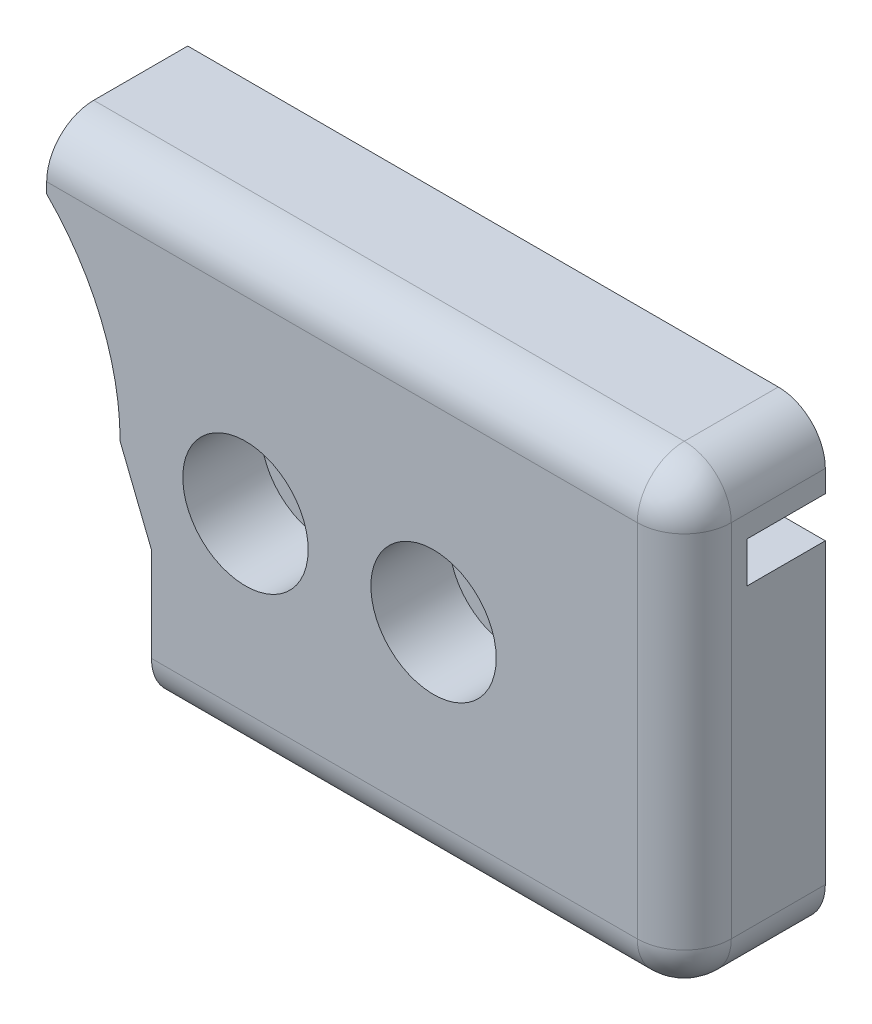
ISO-10303-21;
HEADER;
FILE_DESCRIPTION(('STEP AP214'),'2;1');
FILE_NAME('part.step','',(''),(''),'','','');
FILE_SCHEMA(('AUTOMOTIVE_DESIGN { 1 0 10303 214 1 1 1 1 }'));
ENDSEC;
DATA;
#1=APPLICATION_CONTEXT('core data for automotive mechanical design processes');
#2=APPLICATION_PROTOCOL_DEFINITION('international standard','automotive_design',2000,#1);
#3=PRODUCT_CONTEXT('',#1,'mechanical');
#4=PRODUCT('Part','Part','',(#3));
#5=PRODUCT_RELATED_PRODUCT_CATEGORY('part','',(#4));
#6=PRODUCT_DEFINITION_FORMATION('','',#4);
#7=PRODUCT_DEFINITION_CONTEXT('part definition',#1,'design');
#8=PRODUCT_DEFINITION('design','',#6,#7);
#9=PRODUCT_DEFINITION_SHAPE('','',#8);
#10=(LENGTH_UNIT() NAMED_UNIT(*) SI_UNIT(.MILLI.,.METRE.));
#11=(NAMED_UNIT(*) PLANE_ANGLE_UNIT() SI_UNIT($,.RADIAN.));
#12=(NAMED_UNIT(*) SI_UNIT($,.STERADIAN.) SOLID_ANGLE_UNIT());
#13=UNCERTAINTY_MEASURE_WITH_UNIT(LENGTH_MEASURE(1.E-05),#10,'distance_accuracy_value','');
#14=(GEOMETRIC_REPRESENTATION_CONTEXT(3) GLOBAL_UNCERTAINTY_ASSIGNED_CONTEXT((#13)) GLOBAL_UNIT_ASSIGNED_CONTEXT((#10,
#11,#12)) REPRESENTATION_CONTEXT('',''));
#15=CARTESIAN_POINT('',(0.,0.,0.));
#16=DIRECTION('',(0.,0.,1.));
#17=DIRECTION('',(1.,0.,0.));
#18=AXIS2_PLACEMENT_3D('',#15,#16,#17);
#19=CARTESIAN_POINT('',(0.,0.,-2.5));
#20=DIRECTION('',(0.,0.,-1.));
#21=DIRECTION('',(-1.,0.,0.));
#22=AXIS2_PLACEMENT_3D('',#19,#20,#21);
#23=PLANE('',#22);
#24=CARTESIAN_POINT('',(18.,0.,-2.5));
#25=DIRECTION('',(0.,0.,-1.));
#26=DIRECTION('',(-1.,0.,0.));
#27=AXIS2_PLACEMENT_3D('',#24,#25,#26);
#28=CIRCLE('',#27,0.950000000000001);
#29=CARTESIAN_POINT('',(17.05,0.,-2.5));
#30=VERTEX_POINT('',#29);
#31=EDGE_CURVE('E233',#30,#30,#28,.F.);
#32=ORIENTED_EDGE('',*,*,#31,.T.);
#33=EDGE_LOOP('',(#32));
#34=FACE_BOUND('',#33,.T.);
#35=DIRECTION('',(-1.,0.,0.));
#36=VECTOR('',#35,1.);
#37=CARTESIAN_POINT('',(26.,-7.00163526528755,-2.5));
#38=LINE('',#37,#36);
#39=CARTESIAN_POINT('',(24.5,-7.00163526528755,-2.5));
#40=VERTEX_POINT('',#39);
#41=CARTESIAN_POINT('',(9.00000000000001,-7.00163526528755,-2.5));
#42=VERTEX_POINT('',#41);
#43=EDGE_CURVE('E222',#40,#42,#38,.T.);
#44=ORIENTED_EDGE('',*,*,#43,.T.);
#45=DIRECTION('',(0.,1.,0.));
#46=VECTOR('',#45,1.);
#47=CARTESIAN_POINT('',(9.00000000000001,-7.00163526528755,-2.5));
#48=LINE('',#47,#46);
#49=CARTESIAN_POINT('',(9.00000000000001,-2.50163526528762,-2.5));
#50=VERTEX_POINT('',#49);
#51=EDGE_CURVE('E226',#42,#50,#48,.T.);
#52=ORIENTED_EDGE('',*,*,#51,.T.);
#53=DIRECTION('',(-0.371181363469624,0.92856038867315,0.));
#54=VECTOR('',#53,1.);
#55=CARTESIAN_POINT('',(8.00000000000001,0.,-2.5));
#56=LINE('',#55,#54);
#57=CARTESIAN_POINT('',(8.00000000000001,0.,-2.5));
#58=VERTEX_POINT('',#57);
#59=EDGE_CURVE('E44',#50,#58,#56,.T.);
#60=ORIENTED_EDGE('',*,*,#59,.T.);
#61=CARTESIAN_POINT('',(0.,0.,-2.5));
#62=DIRECTION('',(0.,0.,1.));
#63=DIRECTION('',(-1.,0.,0.));
#64=AXIS2_PLACEMENT_3D('',#61,#62,#63);
#65=CIRCLE('',#64,8.00000000000001);
#66=CARTESIAN_POINT('',(6.9291470938499,3.99836473471238,-2.5));
#67=VERTEX_POINT('',#66);
#68=EDGE_CURVE('E179',#58,#67,#65,.T.);
#69=ORIENTED_EDGE('',*,*,#68,.T.);
#70=DIRECTION('',(-1.,0.,0.));
#71=VECTOR('',#70,1.);
#72=CARTESIAN_POINT('',(0.,3.99836473471238,-2.5));
#73=LINE('',#72,#71);
#74=CARTESIAN_POINT('',(26.,3.99836473471238,-2.5));
#75=VERTEX_POINT('',#74);
#76=EDGE_CURVE('E58',#75,#67,#73,.T.);
#77=ORIENTED_EDGE('',*,*,#76,.F.);
#78=DIRECTION('',(0.,-1.,0.));
#79=VECTOR('',#78,1.);
#80=CARTESIAN_POINT('',(26.,-7.00163526528755,-2.5));
#81=LINE('',#80,#79);
#82=CARTESIAN_POINT('',(26.,-5.50163526528755,-2.5));
#83=VERTEX_POINT('',#82);
#84=EDGE_CURVE('E218',#75,#83,#81,.T.);
#85=ORIENTED_EDGE('',*,*,#84,.T.);
#86=CARTESIAN_POINT('',(24.5,-5.50163526528755,-2.5));
#87=DIRECTION('',(0.,0.,-1.));
#88=DIRECTION('',(-1.,0.,0.));
#89=AXIS2_PLACEMENT_3D('',#86,#87,#88);
#90=CIRCLE('',#89,1.5);
#91=EDGE_CURVE('E237',#40,#83,#90,.F.);
#92=ORIENTED_EDGE('',*,*,#91,.F.);
#93=EDGE_LOOP('',(#44,#52,#60,#69,#77,#85,#92));
#94=FACE_BOUND('',#93,.T.);
#95=CARTESIAN_POINT('',(12.,0.,-2.5));
#96=DIRECTION('',(0.,0.,-1.));
#97=DIRECTION('',(-1.,0.,0.));
#98=AXIS2_PLACEMENT_3D('',#95,#96,#97);
#99=CIRCLE('',#98,0.949999999999999);
#100=CARTESIAN_POINT('',(11.05,0.,-2.5));
#101=VERTEX_POINT('',#100);
#102=EDGE_CURVE('E229',#101,#101,#99,.F.);
#103=ORIENTED_EDGE('',*,*,#102,.T.);
#104=EDGE_LOOP('',(#103));
#105=FACE_BOUND('',#104,.T.);
#106=ADVANCED_FACE('F40',(#34,#94,#105),#23,.T.);
#107=CARTESIAN_POINT('',(5.99394120241067,5.29836473471238,-2.5));
#108=VERTEX_POINT('',#107);
#109=CARTESIAN_POINT('',(5.65685424949238,5.65685424949239,-2.5));
#110=VERTEX_POINT('',#109);
#111=EDGE_CURVE('E160',#108,#110,#65,.T.);
#112=ORIENTED_EDGE('',*,*,#111,.T.);
#113=DIRECTION('',(0.,1.,0.));
#114=VECTOR('',#113,1.);
#115=CARTESIAN_POINT('',(5.65685424949238,5.65685424949239,-2.5));
#116=LINE('',#115,#114);
#117=CARTESIAN_POINT('',(5.65685424949238,7.49836473471238,-2.5));
#118=VERTEX_POINT('',#117);
#119=EDGE_CURVE('E171',#110,#118,#116,.T.);
#120=ORIENTED_EDGE('',*,*,#119,.T.);
#121=DIRECTION('',(1.,0.,0.));
#122=VECTOR('',#121,1.);
#123=CARTESIAN_POINT('',(5.65685424949238,7.49836473471238,-2.5));
#124=LINE('',#123,#122);
#125=CARTESIAN_POINT('',(24.5,7.49836473471239,-2.5));
#126=VERTEX_POINT('',#125);
#127=EDGE_CURVE('E178',#118,#126,#124,.T.);
#128=ORIENTED_EDGE('',*,*,#127,.T.);
#129=CARTESIAN_POINT('',(24.5,5.99836473471239,-2.5));
#130=DIRECTION('',(0.,0.,-1.));
#131=DIRECTION('',(-1.,0.,0.));
#132=AXIS2_PLACEMENT_3D('',#129,#130,#131);
#133=CIRCLE('',#132,1.5);
#134=CARTESIAN_POINT('',(26.,5.99836473471239,-2.5));
#135=VERTEX_POINT('',#134);
#136=EDGE_CURVE('E240',#135,#126,#133,.F.);
#137=ORIENTED_EDGE('',*,*,#136,.F.);
#138=CARTESIAN_POINT('',(26.,5.29836473471238,-2.5));
#139=VERTEX_POINT('',#138);
#140=EDGE_CURVE('E221',#135,#139,#81,.T.);
#141=ORIENTED_EDGE('',*,*,#140,.T.);
#142=DIRECTION('',(1.,0.,0.));
#143=VECTOR('',#142,1.);
#144=CARTESIAN_POINT('',(0.,5.29836473471238,-2.5));
#145=LINE('',#144,#143);
#146=EDGE_CURVE('E184',#108,#139,#145,.T.);
#147=ORIENTED_EDGE('',*,*,#146,.F.);
#148=EDGE_LOOP('',(#112,#120,#128,#137,#141,#147));
#149=FACE_BOUND('',#148,.T.);
#150=ADVANCED_FACE('F182',(#149),#23,.T.);
#151=CARTESIAN_POINT('',(22.,-4.00163526528755,-1.));
#152=DIRECTION('',(0.,-1.,0.));
#153=DIRECTION('',(1.,0.,0.));
#154=AXIS2_PLACEMENT_3D('',#151,#152,#153);
#155=PLANE('',#154);
#156=CARTESIAN_POINT('',(22.,-4.00163526528755,-1.));
#157=DIRECTION('',(0.,-1.,0.));
#158=DIRECTION('',(1.,0.,0.));
#159=AXIS2_PLACEMENT_3D('',#156,#157,#158);
#160=CIRCLE('',#159,0.950000000000001);
#161=CARTESIAN_POINT('',(22.95,-4.00163526528755,-1.));
#162=VERTEX_POINT('',#161);
#163=EDGE_CURVE('E248',#162,#162,#160,.T.);
#164=ORIENTED_EDGE('',*,*,#163,.T.);
#165=EDGE_LOOP('',(#164));
#166=FACE_BOUND('',#165,.T.);
#167=ADVANCED_FACE('F437',(#166),#155,.T.);
#168=CARTESIAN_POINT('',(18.,-4.00163526528755,-1.));
#169=DIRECTION('',(0.,-1.,0.));
#170=DIRECTION('',(1.,0.,0.));
#171=AXIS2_PLACEMENT_3D('',#168,#169,#170);
#172=PLANE('',#171);
#173=CARTESIAN_POINT('',(18.,-4.00163526528755,-1.));
#174=DIRECTION('',(0.,-1.,0.));
#175=DIRECTION('',(1.,0.,0.));
#176=AXIS2_PLACEMENT_3D('',#173,#174,#175);
#177=CIRCLE('',#176,0.950000000000001);
#178=CARTESIAN_POINT('',(18.95,-4.00163526528755,-1.));
#179=VERTEX_POINT('',#178);
#180=EDGE_CURVE('E50',#179,#179,#177,.T.);
#181=ORIENTED_EDGE('',*,*,#180,.T.);
#182=EDGE_LOOP('',(#181));
#183=FACE_BOUND('',#182,.T.);
#184=ADVANCED_FACE('F439',(#183),#172,.T.);
#185=CARTESIAN_POINT('',(18.,0.,-0.5));
#186=DIRECTION('',(0.,0.,1.));
#187=DIRECTION('',(1.,0.,0.));
#188=AXIS2_PLACEMENT_3D('',#185,#186,#187);
#189=CYLINDRICAL_SURFACE('',#188,2.);
#190=CARTESIAN_POINT('',(18.,0.,-0.5));
#191=DIRECTION('',(0.,0.,1.));
#192=DIRECTION('',(1.,0.,0.));
#193=AXIS2_PLACEMENT_3D('',#190,#191,#192);
#194=CIRCLE('',#193,2.);
#195=CARTESIAN_POINT('',(20.,0.,-0.5));
#196=VERTEX_POINT('',#195);
#197=EDGE_CURVE('E269',#196,#196,#194,.T.);
#198=ORIENTED_EDGE('',*,*,#197,.F.);
#199=EDGE_LOOP('',(#198));
#200=FACE_BOUND('',#199,.T.);
#201=CARTESIAN_POINT('',(18.,0.,2.));
#202=DIRECTION('',(0.,0.,1.));
#203=DIRECTION('',(1.,0.,0.));
#204=AXIS2_PLACEMENT_3D('',#201,#202,#203);
#205=CIRCLE('',#204,2.);
#206=CARTESIAN_POINT('',(20.,0.,2.));
#207=VERTEX_POINT('',#206);
#208=EDGE_CURVE('E273',#207,#207,#205,.T.);
#209=ORIENTED_EDGE('',*,*,#208,.T.);
#210=EDGE_LOOP('',(#209));
#211=FACE_BOUND('',#210,.T.);
#212=ADVANCED_FACE('F446',(#200,#211),#189,.F.);
#213=CARTESIAN_POINT('',(12.,0.,-0.5));
#214=DIRECTION('',(0.,0.,1.));
#215=DIRECTION('',(1.,0.,0.));
#216=AXIS2_PLACEMENT_3D('',#213,#214,#215);
#217=CYLINDRICAL_SURFACE('',#216,2.);
#218=CARTESIAN_POINT('',(12.,0.,-0.5));
#219=DIRECTION('',(0.,0.,1.));
#220=DIRECTION('',(1.,0.,0.));
#221=AXIS2_PLACEMENT_3D('',#218,#219,#220);
#222=CIRCLE('',#221,2.);
#223=CARTESIAN_POINT('',(14.,0.,-0.5));
#224=VERTEX_POINT('',#223);
#225=EDGE_CURVE('E260',#224,#224,#222,.T.);
#226=ORIENTED_EDGE('',*,*,#225,.F.);
#227=EDGE_LOOP('',(#226));
#228=FACE_BOUND('',#227,.T.);
#229=CARTESIAN_POINT('',(12.,0.,2.));
#230=DIRECTION('',(0.,0.,1.));
#231=DIRECTION('',(1.,0.,0.));
#232=AXIS2_PLACEMENT_3D('',#229,#230,#231);
#233=CIRCLE('',#232,2.);
#234=CARTESIAN_POINT('',(14.,0.,2.));
#235=VERTEX_POINT('',#234);
#236=EDGE_CURVE('E264',#235,#235,#233,.T.);
#237=ORIENTED_EDGE('',*,*,#236,.T.);
#238=EDGE_LOOP('',(#237));
#239=FACE_BOUND('',#238,.T.);
#240=ADVANCED_FACE('F492',(#228,#239),#217,.F.);
#241=CARTESIAN_POINT('',(22.,-4.00163526528755,-1.));
#242=DIRECTION('',(0.,-1.,0.));
#243=DIRECTION('',(1.,0.,0.));
#244=AXIS2_PLACEMENT_3D('',#241,#242,#243);
#245=CYLINDRICAL_SURFACE('',#244,0.950000000000001);
#246=ORIENTED_EDGE('',*,*,#163,.F.);
#247=EDGE_LOOP('',(#246));
#248=FACE_BOUND('',#247,.T.);
#249=CARTESIAN_POINT('',(22.,-7.00163526528755,-1.));
#250=DIRECTION('',(0.,-1.,0.));
#251=DIRECTION('',(1.,0.,0.));
#252=AXIS2_PLACEMENT_3D('',#249,#250,#251);
#253=CIRCLE('',#252,0.950000000000001);
#254=CARTESIAN_POINT('',(22.95,-7.00163526528755,-1.));
#255=VERTEX_POINT('',#254);
#256=EDGE_CURVE('E252',#255,#255,#253,.T.);
#257=ORIENTED_EDGE('',*,*,#256,.T.);
#258=EDGE_LOOP('',(#257));
#259=FACE_BOUND('',#258,.T.);
#260=ADVANCED_FACE('F451',(#248,#259),#245,.F.);
#261=CARTESIAN_POINT('',(18.,-4.00163526528755,-1.));
#262=DIRECTION('',(0.,-1.,0.));
#263=DIRECTION('',(1.,0.,0.));
#264=AXIS2_PLACEMENT_3D('',#261,#262,#263);
#265=CYLINDRICAL_SURFACE('',#264,0.950000000000001);
#266=ORIENTED_EDGE('',*,*,#180,.F.);
#267=EDGE_LOOP('',(#266));
#268=FACE_BOUND('',#267,.T.);
#269=CARTESIAN_POINT('',(18.,-7.00163526528755,-1.));
#270=DIRECTION('',(0.,-1.,0.));
#271=DIRECTION('',(1.,0.,0.));
#272=AXIS2_PLACEMENT_3D('',#269,#270,#271);
#273=CIRCLE('',#272,0.950000000000001);
#274=CARTESIAN_POINT('',(18.95,-7.00163526528755,-1.));
#275=VERTEX_POINT('',#274);
#276=EDGE_CURVE('E11',#275,#275,#273,.T.);
#277=ORIENTED_EDGE('',*,*,#276,.T.);
#278=EDGE_LOOP('',(#277));
#279=FACE_BOUND('',#278,.T.);
#280=ADVANCED_FACE('F493',(#268,#279),#265,.F.);
#281=CARTESIAN_POINT('',(24.5,0.,0.5));
#282=DIRECTION('',(0.,-1.,0.));
#283=DIRECTION('',(0.,0.,-1.));
#284=AXIS2_PLACEMENT_3D('',#281,#282,#283);
#285=CYLINDRICAL_SURFACE('',#284,1.5);
#286=CARTESIAN_POINT('',(24.5,-5.50163526528755,0.5));
#287=DIRECTION('',(0.,-1.,0.));
#288=DIRECTION('',(0.,0.,-1.));
#289=AXIS2_PLACEMENT_3D('',#286,#287,#288);
#290=CIRCLE('',#289,1.5);
#291=CARTESIAN_POINT('',(24.5,-5.50163526528755,2.));
#292=VERTEX_POINT('',#291);
#293=CARTESIAN_POINT('',(26.,-5.50163526528755,0.5));
#294=VERTEX_POINT('',#293);
#295=EDGE_CURVE('E348',#292,#294,#290,.F.);
#296=ORIENTED_EDGE('',*,*,#295,.T.);
#297=DIRECTION('',(0.,1.,0.));
#298=VECTOR('',#297,1.);
#299=CARTESIAN_POINT('',(26.,-7.00163526528755,0.5));
#300=LINE('',#299,#298);
#301=CARTESIAN_POINT('',(26.,5.99836473471239,0.5));
#302=VERTEX_POINT('',#301);
#303=EDGE_CURVE('E200',#302,#294,#300,.F.);
#304=ORIENTED_EDGE('',*,*,#303,.F.);
#305=CARTESIAN_POINT('',(24.5,5.99836473471239,0.5));
#306=DIRECTION('',(0.,1.,0.));
#307=DIRECTION('',(0.,0.,1.));
#308=AXIS2_PLACEMENT_3D('',#305,#306,#307);
#309=CIRCLE('',#308,1.5);
#310=CARTESIAN_POINT('',(24.5,5.99836473471239,2.));
#311=VERTEX_POINT('',#310);
#312=EDGE_CURVE('E253',#302,#311,#309,.F.);
#313=ORIENTED_EDGE('',*,*,#312,.T.);
#314=DIRECTION('',(0.,1.,0.));
#315=VECTOR('',#314,1.);
#316=CARTESIAN_POINT('',(24.5,7.49836473471239,2.));
#317=LINE('',#316,#315);
#318=EDGE_CURVE('E330',#292,#311,#317,.T.);
#319=ORIENTED_EDGE('',*,*,#318,.F.);
#320=EDGE_LOOP('',(#296,#304,#313,#319));
#321=FACE_BOUND('',#320,.T.);
#322=ADVANCED_FACE('F377',(#321),#285,.T.);
#323=CARTESIAN_POINT('',(0.,5.99836473471238,0.5));
#324=DIRECTION('',(1.,0.,0.));
#325=DIRECTION('',(0.,1.,0.));
#326=AXIS2_PLACEMENT_3D('',#323,#324,#325);
#327=CYLINDRICAL_SURFACE('',#326,1.5);
#328=CARTESIAN_POINT('',(5.65685424949238,5.99836473471239,0.5));
#329=DIRECTION('',(1.,0.,0.));
#330=DIRECTION('',(0.,0.,-1.));
#331=AXIS2_PLACEMENT_3D('',#328,#329,#330);
#332=CIRCLE('',#331,1.5);
#333=CARTESIAN_POINT('',(5.65685424949238,5.99836473471239,2.));
#334=VERTEX_POINT('',#333);
#335=CARTESIAN_POINT('',(5.65685424949238,7.49836473471238,0.5));
#336=VERTEX_POINT('',#335);
#337=EDGE_CURVE('E213',#334,#336,#332,.F.);
#338=ORIENTED_EDGE('',*,*,#337,.F.);
#339=DIRECTION('',(-1.,0.,0.));
#340=VECTOR('',#339,1.);
#341=CARTESIAN_POINT('',(5.65685424949238,5.99836473471239,2.));
#342=LINE('',#341,#340);
#343=EDGE_CURVE('E321',#311,#334,#342,.T.);
#344=ORIENTED_EDGE('',*,*,#343,.F.);
#345=CARTESIAN_POINT('',(24.5,5.99836473471239,0.5));
#346=DIRECTION('',(1.,0.,0.));
#347=DIRECTION('',(0.,0.,-1.));
#348=AXIS2_PLACEMENT_3D('',#345,#346,#347);
#349=CIRCLE('',#348,1.5);
#350=CARTESIAN_POINT('',(24.5,7.49836473471239,0.5));
#351=VERTEX_POINT('',#350);
#352=EDGE_CURVE('E356',#351,#311,#349,.T.);
#353=ORIENTED_EDGE('',*,*,#352,.F.);
#354=DIRECTION('',(-1.,0.,0.));
#355=VECTOR('',#354,1.);
#356=CARTESIAN_POINT('',(26.,7.49836473471239,0.5));
#357=LINE('',#356,#355);
#358=EDGE_CURVE('E214',#336,#351,#357,.F.);
#359=ORIENTED_EDGE('',*,*,#358,.F.);
#360=EDGE_LOOP('',(#338,#344,#353,#359));
#361=FACE_BOUND('',#360,.T.);
#362=ADVANCED_FACE('F414',(#361),#327,.T.);
#363=CARTESIAN_POINT('',(0.,-5.50163526528755,0.5));
#364=DIRECTION('',(-1.,0.,0.));
#365=DIRECTION('',(0.,-1.,0.));
#366=AXIS2_PLACEMENT_3D('',#363,#364,#365);
#367=CYLINDRICAL_SURFACE('',#366,1.5);
#368=CARTESIAN_POINT('',(9.00000000000001,-5.50163526528755,0.5));
#369=DIRECTION('',(1.,0.,0.));
#370=DIRECTION('',(0.,0.,-1.));
#371=AXIS2_PLACEMENT_3D('',#368,#369,#370);
#372=CIRCLE('',#371,1.5);
#373=CARTESIAN_POINT('',(9.00000000000001,-7.00163526528755,0.5));
#374=VERTEX_POINT('',#373);
#375=CARTESIAN_POINT('',(9.00000000000001,-5.50163526528755,2.));
#376=VERTEX_POINT('',#375);
#377=EDGE_CURVE('E209',#374,#376,#372,.F.);
#378=ORIENTED_EDGE('',*,*,#377,.F.);
#379=DIRECTION('',(1.,0.,0.));
#380=VECTOR('',#379,1.);
#381=CARTESIAN_POINT('',(9.00000000000001,-7.00163526528755,0.5));
#382=LINE('',#381,#380);
#383=CARTESIAN_POINT('',(24.5,-7.00163526528755,0.5));
#384=VERTEX_POINT('',#383);
#385=EDGE_CURVE('E205',#384,#374,#382,.F.);
#386=ORIENTED_EDGE('',*,*,#385,.F.);
#387=CARTESIAN_POINT('',(24.5,-5.50163526528755,0.5));
#388=DIRECTION('',(1.,0.,0.));
#389=DIRECTION('',(0.,0.,-1.));
#390=AXIS2_PLACEMENT_3D('',#387,#388,#389);
#391=CIRCLE('',#390,1.5);
#392=EDGE_CURVE('E360',#292,#384,#391,.T.);
#393=ORIENTED_EDGE('',*,*,#392,.F.);
#394=DIRECTION('',(1.,0.,0.));
#395=VECTOR('',#394,1.);
#396=CARTESIAN_POINT('',(26.,-5.50163526528755,2.));
#397=LINE('',#396,#395);
#398=EDGE_CURVE('E199',#376,#292,#397,.T.);
#399=ORIENTED_EDGE('',*,*,#398,.F.);
#400=EDGE_LOOP('',(#378,#386,#393,#399));
#401=FACE_BOUND('',#400,.T.);
#402=ADVANCED_FACE('F387',(#401),#367,.T.);
#403=CARTESIAN_POINT('',(9.00000000000001,-7.00163526528755,2.));
#404=DIRECTION('',(1.,0.,0.));
#405=DIRECTION('',(0.,0.,-1.));
#406=AXIS2_PLACEMENT_3D('',#403,#404,#405);
#407=PLANE('',#406);
#408=ORIENTED_EDGE('',*,*,#51,.F.);
#409=DIRECTION('',(0.,0.,-1.));
#410=VECTOR('',#409,1.);
#411=CARTESIAN_POINT('',(9.00000000000001,-7.00163526528755,2.));
#412=LINE('',#411,#410);
#413=EDGE_CURVE('E192',#374,#42,#412,.T.);
#414=ORIENTED_EDGE('',*,*,#413,.F.);
#415=ORIENTED_EDGE('',*,*,#377,.T.);
#416=DIRECTION('',(0.,-1.,0.));
#417=VECTOR('',#416,1.);
#418=CARTESIAN_POINT('',(9.00000000000001,-7.00163526528755,2.));
#419=LINE('',#418,#417);
#420=CARTESIAN_POINT('',(9.00000000000001,-2.50163526528762,2.));
#421=VERTEX_POINT('',#420);
#422=EDGE_CURVE('E308',#421,#376,#419,.T.);
#423=ORIENTED_EDGE('',*,*,#422,.F.);
#424=DIRECTION('',(0.,0.,-1.));
#425=VECTOR('',#424,1.);
#426=CARTESIAN_POINT('',(9.00000000000001,-2.50163526528762,2.));
#427=LINE('',#426,#425);
#428=EDGE_CURVE('E195',#421,#50,#427,.T.);
#429=ORIENTED_EDGE('',*,*,#428,.T.);
#430=EDGE_LOOP('',(#408,#414,#415,#423,#429));
#431=FACE_BOUND('',#430,.T.);
#432=ADVANCED_FACE('F394',(#431),#407,.F.);
#433=CARTESIAN_POINT('',(5.65685424949238,5.65685424949239,2.));
#434=DIRECTION('',(1.,0.,0.));
#435=DIRECTION('',(0.,0.,-1.));
#436=AXIS2_PLACEMENT_3D('',#433,#434,#435);
#437=PLANE('',#436);
#438=ORIENTED_EDGE('',*,*,#119,.F.);
#439=DIRECTION('',(0.,0.,-1.));
#440=VECTOR('',#439,1.);
#441=CARTESIAN_POINT('',(5.65685424949238,5.65685424949239,2.));
#442=LINE('',#441,#440);
#443=CARTESIAN_POINT('',(5.65685424949238,5.65685424949239,2.));
#444=VERTEX_POINT('',#443);
#445=EDGE_CURVE('E155',#444,#110,#442,.T.);
#446=ORIENTED_EDGE('',*,*,#445,.F.);
#447=DIRECTION('',(0.,-1.,0.));
#448=VECTOR('',#447,1.);
#449=CARTESIAN_POINT('',(5.65685424949238,5.65685424949239,2.));
#450=LINE('',#449,#448);
#451=EDGE_CURVE('E167',#334,#444,#450,.T.);
#452=ORIENTED_EDGE('',*,*,#451,.F.);
#453=ORIENTED_EDGE('',*,*,#337,.T.);
#454=DIRECTION('',(0.,0.,-1.));
#455=VECTOR('',#454,1.);
#456=CARTESIAN_POINT('',(5.65685424949238,7.49836473471238,2.));
#457=LINE('',#456,#455);
#458=EDGE_CURVE('E168',#336,#118,#457,.T.);
#459=ORIENTED_EDGE('',*,*,#458,.T.);
#460=EDGE_LOOP('',(#438,#446,#452,#453,#459));
#461=FACE_BOUND('',#460,.T.);
#462=ADVANCED_FACE('F172',(#461),#437,.F.);
#463=CARTESIAN_POINT('',(0.,0.,2.));
#464=DIRECTION('',(0.,0.,1.));
#465=DIRECTION('',(1.,0.,0.));
#466=AXIS2_PLACEMENT_3D('',#463,#464,#465);
#467=PLANE('',#466);
#468=ORIENTED_EDGE('',*,*,#236,.F.);
#469=EDGE_LOOP('',(#468));
#470=FACE_BOUND('',#469,.T.);
#471=ORIENTED_EDGE('',*,*,#208,.F.);
#472=EDGE_LOOP('',(#471));
#473=FACE_BOUND('',#472,.T.);
#474=ORIENTED_EDGE('',*,*,#422,.T.);
#475=ORIENTED_EDGE('',*,*,#398,.T.);
#476=ORIENTED_EDGE('',*,*,#318,.T.);
#477=ORIENTED_EDGE('',*,*,#343,.T.);
#478=ORIENTED_EDGE('',*,*,#451,.T.);
#479=CARTESIAN_POINT('',(0.,0.,2.));
#480=DIRECTION('',(0.,0.,-1.));
#481=DIRECTION('',(1.,0.,0.));
#482=AXIS2_PLACEMENT_3D('',#479,#480,#481);
#483=CIRCLE('',#482,8.00000000000001);
#484=CARTESIAN_POINT('',(8.00000000000001,0.,2.));
#485=VERTEX_POINT('',#484);
#486=EDGE_CURVE('E163',#444,#485,#483,.T.);
#487=ORIENTED_EDGE('',*,*,#486,.T.);
#488=DIRECTION('',(0.371181363469624,-0.92856038867315,0.));
#489=VECTOR('',#488,1.);
#490=CARTESIAN_POINT('',(8.00000000000001,0.,2.));
#491=LINE('',#490,#489);
#492=EDGE_CURVE('E305',#485,#421,#491,.T.);
#493=ORIENTED_EDGE('',*,*,#492,.T.);
#494=EDGE_LOOP('',(#474,#475,#476,#477,#478,#487,#493));
#495=FACE_BOUND('',#494,.T.);
#496=ADVANCED_FACE('F380',(#470,#473,#495),#467,.T.);
#497=CARTESIAN_POINT('',(8.00000000000001,0.,2.));
#498=DIRECTION('',(0.92856038867315,0.371181363469624,0.));
#499=DIRECTION('',(-0.371181363469624,0.92856038867315,0.));
#500=AXIS2_PLACEMENT_3D('',#497,#498,#499);
#501=PLANE('',#500);
#502=DIRECTION('',(0.,0.,-1.));
#503=VECTOR('',#502,1.);
#504=CARTESIAN_POINT('',(8.00000000000001,0.,2.));
#505=LINE('',#504,#503);
#506=EDGE_CURVE('E247',#485,#58,#505,.T.);
#507=ORIENTED_EDGE('',*,*,#506,.T.);
#508=ORIENTED_EDGE('',*,*,#59,.F.);
#509=ORIENTED_EDGE('',*,*,#428,.F.);
#510=ORIENTED_EDGE('',*,*,#492,.F.);
#511=EDGE_LOOP('',(#507,#508,#509,#510));
#512=FACE_BOUND('',#511,.T.);
#513=ADVANCED_FACE('F426',(#512),#501,.F.);
#514=CARTESIAN_POINT('',(26.,5.29836473471238,0.));
#515=DIRECTION('',(0.,1.,0.));
#516=DIRECTION('',(0.,0.,1.));
#517=AXIS2_PLACEMENT_3D('',#514,#515,#516);
#518=PLANE('',#517);
#519=ORIENTED_EDGE('',*,*,#146,.T.);
#520=DIRECTION('',(0.,0.,-1.));
#521=VECTOR('',#520,1.);
#522=CARTESIAN_POINT('',(26.,5.29836473471238,2.));
#523=LINE('',#522,#521);
#524=CARTESIAN_POINT('',(26.,5.29836473471238,0.));
#525=VERTEX_POINT('',#524);
#526=EDGE_CURVE('E292',#525,#139,#523,.T.);
#527=ORIENTED_EDGE('',*,*,#526,.F.);
#528=DIRECTION('',(1.,0.,0.));
#529=VECTOR('',#528,1.);
#530=CARTESIAN_POINT('',(29.8495351115723,5.29836473471238,0.));
#531=LINE('',#530,#529);
#532=CARTESIAN_POINT('',(5.99394120241067,5.29836473471238,0.));
#533=VERTEX_POINT('',#532);
#534=EDGE_CURVE('E278',#533,#525,#531,.T.);
#535=ORIENTED_EDGE('',*,*,#534,.F.);
#536=DIRECTION('',(0.,0.,-1.));
#537=VECTOR('',#536,1.);
#538=CARTESIAN_POINT('',(5.99394120241067,5.29836473471238,2.));
#539=LINE('',#538,#537);
#540=EDGE_CURVE('E296',#108,#533,#539,.F.);
#541=ORIENTED_EDGE('',*,*,#540,.F.);
#542=EDGE_LOOP('',(#519,#527,#535,#541));
#543=FACE_BOUND('',#542,.T.);
#544=ADVANCED_FACE('F420',(#543),#518,.F.);
#545=CARTESIAN_POINT('',(0.,0.,2.));
#546=DIRECTION('',(0.,0.,-1.));
#547=DIRECTION('',(-1.,0.,0.));
#548=AXIS2_PLACEMENT_3D('',#545,#546,#547);
#549=CYLINDRICAL_SURFACE('',#548,8.00000000000001);
#550=ORIENTED_EDGE('',*,*,#111,.F.);
#551=ORIENTED_EDGE('',*,*,#540,.T.);
#552=CARTESIAN_POINT('',(0.,0.,0.));
#553=DIRECTION('',(0.,0.,1.));
#554=DIRECTION('',(1.,0.,0.));
#555=AXIS2_PLACEMENT_3D('',#552,#553,#554);
#556=CIRCLE('',#555,8.00000000000001);
#557=CARTESIAN_POINT('',(6.9291470938499,3.99836473471238,0.));
#558=VERTEX_POINT('',#557);
#559=EDGE_CURVE('E299',#533,#558,#556,.F.);
#560=ORIENTED_EDGE('',*,*,#559,.T.);
#561=DIRECTION('',(0.,0.,-1.));
#562=VECTOR('',#561,1.);
#563=CARTESIAN_POINT('',(6.9291470938499,3.99836473471238,2.));
#564=LINE('',#563,#562);
#565=EDGE_CURVE('E289',#558,#67,#564,.T.);
#566=ORIENTED_EDGE('',*,*,#565,.T.);
#567=ORIENTED_EDGE('',*,*,#68,.F.);
#568=ORIENTED_EDGE('',*,*,#506,.F.);
#569=ORIENTED_EDGE('',*,*,#486,.F.);
#570=ORIENTED_EDGE('',*,*,#445,.T.);
#571=EDGE_LOOP('',(#550,#551,#560,#566,#567,#568,#569,#570));
#572=FACE_BOUND('',#571,.T.);
#573=ADVANCED_FACE('F157',(#572),#549,.F.);
#574=CARTESIAN_POINT('',(24.5,-5.50163526528755,0.5));
#575=DIRECTION('',(0.,0.,1.));
#576=DIRECTION('',(1.,0.,0.));
#577=AXIS2_PLACEMENT_3D('',#574,#575,#576);
#578=SPHERICAL_SURFACE('',#577,1.5);
#579=ORIENTED_EDGE('',*,*,#392,.T.);
#580=CARTESIAN_POINT('',(24.5,-5.50163526528755,0.5));
#581=DIRECTION('',(0.,0.,1.));
#582=DIRECTION('',(1.,0.,0.));
#583=AXIS2_PLACEMENT_3D('',#580,#581,#582);
#584=CIRCLE('',#583,1.5);
#585=EDGE_CURVE('E277',#384,#294,#584,.T.);
#586=ORIENTED_EDGE('',*,*,#585,.T.);
#587=ORIENTED_EDGE('',*,*,#295,.F.);
#588=EDGE_LOOP('',(#579,#586,#587));
#589=FACE_BOUND('',#588,.T.);
#590=ADVANCED_FACE('F369',(#589),#578,.T.);
#591=CARTESIAN_POINT('',(24.5,5.99836473471239,0.5));
#592=DIRECTION('',(0.,0.,1.));
#593=DIRECTION('',(1.,0.,0.));
#594=AXIS2_PLACEMENT_3D('',#591,#592,#593);
#595=SPHERICAL_SURFACE('',#594,1.5);
#596=CARTESIAN_POINT('',(24.5,5.99836473471239,0.5));
#597=DIRECTION('',(0.,0.,1.));
#598=DIRECTION('',(1.,0.,0.));
#599=AXIS2_PLACEMENT_3D('',#596,#597,#598);
#600=CIRCLE('',#599,1.5);
#601=EDGE_CURVE('E352',#302,#351,#600,.T.);
#602=ORIENTED_EDGE('',*,*,#601,.T.);
#603=ORIENTED_EDGE('',*,*,#352,.T.);
#604=ORIENTED_EDGE('',*,*,#312,.F.);
#605=EDGE_LOOP('',(#602,#603,#604));
#606=FACE_BOUND('',#605,.T.);
#607=ADVANCED_FACE('F410',(#606),#595,.T.);
#608=CARTESIAN_POINT('',(5.65685424949238,7.49836473471238,2.));
#609=DIRECTION('',(0.,-1.,0.));
#610=DIRECTION('',(1.,0.,0.));
#611=AXIS2_PLACEMENT_3D('',#608,#609,#610);
#612=PLANE('',#611);
#613=ORIENTED_EDGE('',*,*,#127,.F.);
#614=ORIENTED_EDGE('',*,*,#458,.F.);
#615=ORIENTED_EDGE('',*,*,#358,.T.);
#616=DIRECTION('',(0.,0.,-1.));
#617=VECTOR('',#616,1.);
#618=CARTESIAN_POINT('',(24.5,7.49836473471239,2.));
#619=LINE('',#618,#617);
#620=EDGE_CURVE('E210',#351,#126,#619,.T.);
#621=ORIENTED_EDGE('',*,*,#620,.T.);
#622=EDGE_LOOP('',(#613,#614,#615,#621));
#623=FACE_BOUND('',#622,.T.);
#624=ADVANCED_FACE('F416',(#623),#612,.F.);
#625=CARTESIAN_POINT('',(26.,-7.00163526528755,2.));
#626=DIRECTION('',(-1.,0.,0.));
#627=DIRECTION('',(0.,0.,1.));
#628=AXIS2_PLACEMENT_3D('',#625,#626,#627);
#629=PLANE('',#628);
#630=ORIENTED_EDGE('',*,*,#140,.F.);
#631=DIRECTION('',(0.,0.,-1.));
#632=VECTOR('',#631,1.);
#633=CARTESIAN_POINT('',(26.,5.99836473471239,2.));
#634=LINE('',#633,#632);
#635=EDGE_CURVE('E196',#135,#302,#634,.F.);
#636=ORIENTED_EDGE('',*,*,#635,.T.);
#637=ORIENTED_EDGE('',*,*,#303,.T.);
#638=DIRECTION('',(0.,0.,-1.));
#639=VECTOR('',#638,1.);
#640=CARTESIAN_POINT('',(26.,-5.50163526528755,2.));
#641=LINE('',#640,#639);
#642=EDGE_CURVE('E201',#294,#83,#641,.T.);
#643=ORIENTED_EDGE('',*,*,#642,.T.);
#644=ORIENTED_EDGE('',*,*,#84,.F.);
#645=DIRECTION('',(0.,0.,1.));
#646=VECTOR('',#645,1.);
#647=CARTESIAN_POINT('',(26.,3.99836473471238,2.));
#648=LINE('',#647,#646);
#649=CARTESIAN_POINT('',(26.,3.99836473471238,0.));
#650=VERTEX_POINT('',#649);
#651=EDGE_CURVE('E285',#75,#650,#648,.T.);
#652=ORIENTED_EDGE('',*,*,#651,.T.);
#653=DIRECTION('',(0.,1.,0.));
#654=VECTOR('',#653,1.);
#655=CARTESIAN_POINT('',(26.,-7.00163526528755,0.));
#656=LINE('',#655,#654);
#657=EDGE_CURVE('E66',#650,#525,#656,.T.);
#658=ORIENTED_EDGE('',*,*,#657,.T.);
#659=ORIENTED_EDGE('',*,*,#526,.T.);
#660=EDGE_LOOP('',(#630,#636,#637,#643,#644,#652,#658,#659));
#661=FACE_BOUND('',#660,.T.);
#662=ADVANCED_FACE('F402',(#661),#629,.F.);
#663=CARTESIAN_POINT('',(24.5,5.99836473471239,2.));
#664=DIRECTION('',(0.,0.,-1.));
#665=DIRECTION('',(-1.,0.,0.));
#666=AXIS2_PLACEMENT_3D('',#663,#664,#665);
#667=CYLINDRICAL_SURFACE('',#666,1.5);
#668=ORIENTED_EDGE('',*,*,#635,.F.);
#669=ORIENTED_EDGE('',*,*,#136,.T.);
#670=ORIENTED_EDGE('',*,*,#620,.F.);
#671=ORIENTED_EDGE('',*,*,#601,.F.);
#672=EDGE_LOOP('',(#668,#669,#670,#671));
#673=FACE_BOUND('',#672,.T.);
#674=ADVANCED_FACE('F407',(#673),#667,.T.);
#675=CARTESIAN_POINT('',(26.,-7.00163526528755,2.));
#676=DIRECTION('',(0.,1.,0.));
#677=DIRECTION('',(-1.,0.,0.));
#678=AXIS2_PLACEMENT_3D('',#675,#676,#677);
#679=PLANE('',#678);
#680=ORIENTED_EDGE('',*,*,#276,.F.);
#681=EDGE_LOOP('',(#680));
#682=FACE_BOUND('',#681,.T.);
#683=ORIENTED_EDGE('',*,*,#256,.F.);
#684=EDGE_LOOP('',(#683));
#685=FACE_BOUND('',#684,.T.);
#686=ORIENTED_EDGE('',*,*,#43,.F.);
#687=DIRECTION('',(0.,0.,-1.));
#688=VECTOR('',#687,1.);
#689=CARTESIAN_POINT('',(24.5,-7.00163526528755,2.));
#690=LINE('',#689,#688);
#691=EDGE_CURVE('E206',#40,#384,#690,.F.);
#692=ORIENTED_EDGE('',*,*,#691,.T.);
#693=ORIENTED_EDGE('',*,*,#385,.T.);
#694=ORIENTED_EDGE('',*,*,#413,.T.);
#695=EDGE_LOOP('',(#686,#692,#693,#694));
#696=FACE_BOUND('',#695,.T.);
#697=ADVANCED_FACE('F391',(#682,#685,#696),#679,.F.);
#698=CARTESIAN_POINT('',(24.5,-5.50163526528755,2.));
#699=DIRECTION('',(0.,0.,-1.));
#700=DIRECTION('',(-1.,0.,0.));
#701=AXIS2_PLACEMENT_3D('',#698,#699,#700);
#702=CYLINDRICAL_SURFACE('',#701,1.5);
#703=ORIENTED_EDGE('',*,*,#691,.F.);
#704=ORIENTED_EDGE('',*,*,#91,.T.);
#705=ORIENTED_EDGE('',*,*,#642,.F.);
#706=ORIENTED_EDGE('',*,*,#585,.F.);
#707=EDGE_LOOP('',(#703,#704,#705,#706));
#708=FACE_BOUND('',#707,.T.);
#709=ADVANCED_FACE('F398',(#708),#702,.T.);
#710=CARTESIAN_POINT('',(0.,0.,0.));
#711=DIRECTION('',(0.,0.,1.));
#712=DIRECTION('',(1.,0.,0.));
#713=AXIS2_PLACEMENT_3D('',#710,#711,#712);
#714=PLANE('',#713);
#715=ORIENTED_EDGE('',*,*,#534,.T.);
#716=ORIENTED_EDGE('',*,*,#657,.F.);
#717=DIRECTION('',(-1.,0.,0.));
#718=VECTOR('',#717,1.);
#719=CARTESIAN_POINT('',(2.73814114815064,3.99836473471238,0.));
#720=LINE('',#719,#718);
#721=EDGE_CURVE('E282',#650,#558,#720,.T.);
#722=ORIENTED_EDGE('',*,*,#721,.T.);
#723=ORIENTED_EDGE('',*,*,#559,.F.);
#724=EDGE_LOOP('',(#715,#716,#722,#723));
#725=FACE_BOUND('',#724,.T.);
#726=ADVANCED_FACE('F421',(#725),#714,.F.);
#727=CARTESIAN_POINT('',(2.73814114815064,3.99836473471238,0.));
#728=DIRECTION('',(0.,-1.,0.));
#729=DIRECTION('',(1.,0.,0.));
#730=AXIS2_PLACEMENT_3D('',#727,#728,#729);
#731=PLANE('',#730);
#732=ORIENTED_EDGE('',*,*,#721,.F.);
#733=ORIENTED_EDGE('',*,*,#651,.F.);
#734=ORIENTED_EDGE('',*,*,#76,.T.);
#735=ORIENTED_EDGE('',*,*,#565,.F.);
#736=EDGE_LOOP('',(#732,#733,#734,#735));
#737=FACE_BOUND('',#736,.T.);
#738=ADVANCED_FACE('F424',(#737),#731,.F.);
#739=CARTESIAN_POINT('',(12.,0.,-0.5));
#740=DIRECTION('',(0.,0.,1.));
#741=DIRECTION('',(1.,0.,0.));
#742=AXIS2_PLACEMENT_3D('',#739,#740,#741);
#743=PLANE('',#742);
#744=ORIENTED_EDGE('',*,*,#225,.T.);
#745=EDGE_LOOP('',(#744));
#746=FACE_BOUND('',#745,.T.);
#747=CARTESIAN_POINT('',(12.,0.,-0.5));
#748=DIRECTION('',(0.,0.,1.));
#749=DIRECTION('',(1.,0.,0.));
#750=AXIS2_PLACEMENT_3D('',#747,#748,#749);
#751=CIRCLE('',#750,0.949999999999999);
#752=CARTESIAN_POINT('',(12.95,0.,-0.5));
#753=VERTEX_POINT('',#752);
#754=EDGE_CURVE('E265',#753,#753,#751,.F.);
#755=ORIENTED_EDGE('',*,*,#754,.T.);
#756=EDGE_LOOP('',(#755));
#757=FACE_BOUND('',#756,.T.);
#758=ADVANCED_FACE('F472',(#746,#757),#743,.T.);
#759=CARTESIAN_POINT('',(12.,0.,3.2));
#760=DIRECTION('',(0.,0.,-1.));
#761=DIRECTION('',(-1.,0.,0.));
#762=AXIS2_PLACEMENT_3D('',#759,#760,#761);
#763=CYLINDRICAL_SURFACE('',#762,0.949999999999999);
#764=ORIENTED_EDGE('',*,*,#754,.F.);
#765=EDGE_LOOP('',(#764));
#766=FACE_BOUND('',#765,.T.);
#767=ORIENTED_EDGE('',*,*,#102,.F.);
#768=EDGE_LOOP('',(#767));
#769=FACE_BOUND('',#768,.T.);
#770=ADVANCED_FACE('F469',(#766,#769),#763,.F.);
#771=CARTESIAN_POINT('',(18.,0.,-0.5));
#772=DIRECTION('',(0.,0.,1.));
#773=DIRECTION('',(1.,0.,0.));
#774=AXIS2_PLACEMENT_3D('',#771,#772,#773);
#775=PLANE('',#774);
#776=ORIENTED_EDGE('',*,*,#197,.T.);
#777=EDGE_LOOP('',(#776));
#778=FACE_BOUND('',#777,.T.);
#779=CARTESIAN_POINT('',(18.,0.,-0.5));
#780=DIRECTION('',(0.,0.,1.));
#781=DIRECTION('',(1.,0.,0.));
#782=AXIS2_PLACEMENT_3D('',#779,#780,#781);
#783=CIRCLE('',#782,0.950000000000001);
#784=CARTESIAN_POINT('',(18.95,0.,-0.5));
#785=VERTEX_POINT('',#784);
#786=EDGE_CURVE('E281',#785,#785,#783,.F.);
#787=ORIENTED_EDGE('',*,*,#786,.T.);
#788=EDGE_LOOP('',(#787));
#789=FACE_BOUND('',#788,.T.);
#790=ADVANCED_FACE('F471',(#778,#789),#775,.T.);
#791=CARTESIAN_POINT('',(18.,0.,3.2));
#792=DIRECTION('',(0.,0.,-1.));
#793=DIRECTION('',(-1.,0.,0.));
#794=AXIS2_PLACEMENT_3D('',#791,#792,#793);
#795=CYLINDRICAL_SURFACE('',#794,0.950000000000001);
#796=ORIENTED_EDGE('',*,*,#786,.F.);
#797=EDGE_LOOP('',(#796));
#798=FACE_BOUND('',#797,.T.);
#799=ORIENTED_EDGE('',*,*,#31,.F.);
#800=EDGE_LOOP('',(#799));
#801=FACE_BOUND('',#800,.T.);
#802=ADVANCED_FACE('F42',(#798,#801),#795,.F.);
#803=CLOSED_SHELL('',(#106,#150,#167,#184,#212,#240,#260,#280,#322,#362,#402,#432,#462,#496,
#513,#544,#573,#590,#607,#624,#662,#674,#697,#709,#726,#738,#758,#770,#790,#802));
#804=MANIFOLD_SOLID_BREP('B2',#803);
#805=ADVANCED_BREP_SHAPE_REPRESENTATION('',(#18,#804),#14);
#806=SHAPE_DEFINITION_REPRESENTATION(#9,#805);
ENDSEC;
END-ISO-10303-21;
